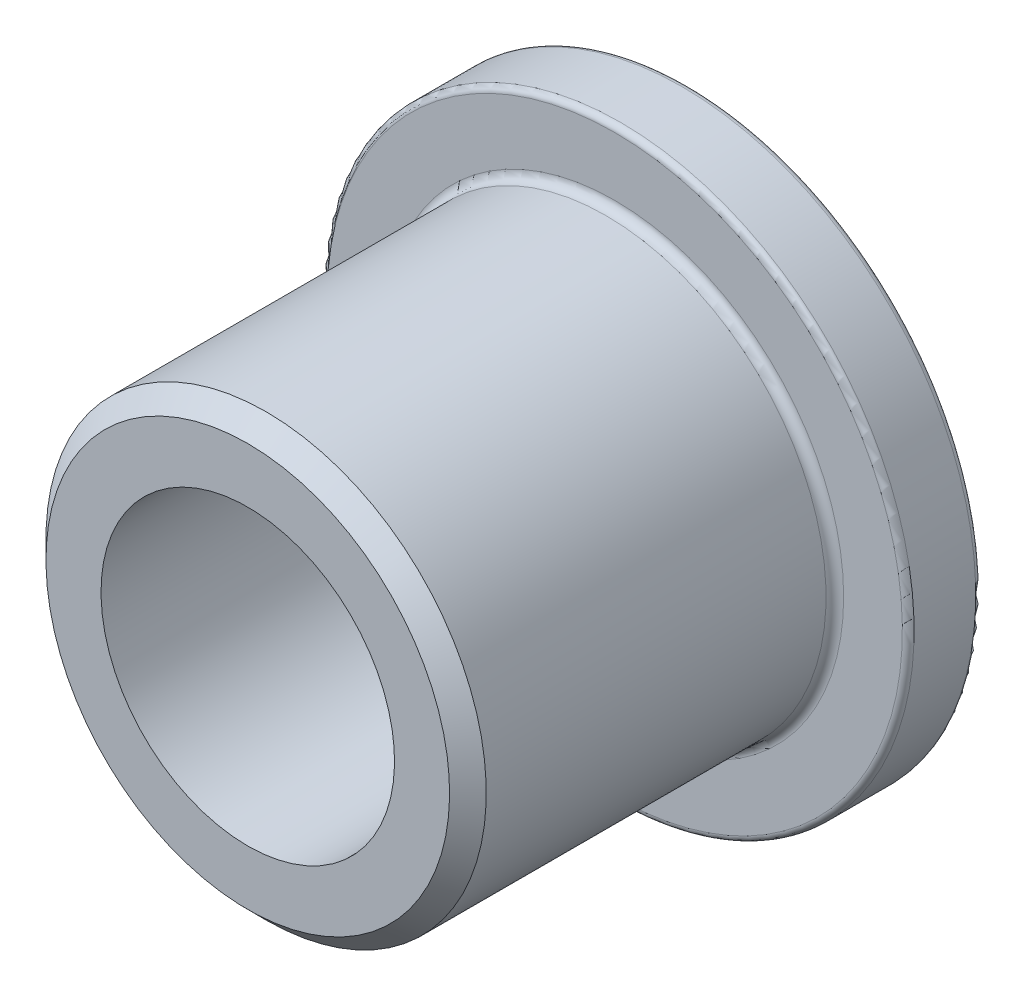
ISO-10303-21;
HEADER;
FILE_DESCRIPTION(('STEP AP214'),'2;1');
FILE_NAME('part.step','',(''),(''),'','','');
FILE_SCHEMA(('AUTOMOTIVE_DESIGN { 1 0 10303 214 1 1 1 1 }'));
ENDSEC;
DATA;
#1=APPLICATION_CONTEXT('core data for automotive mechanical design processes');
#2=APPLICATION_PROTOCOL_DEFINITION('international standard','automotive_design',2000,#1);
#3=PRODUCT_CONTEXT('',#1,'mechanical');
#4=PRODUCT('Part','Part','',(#3));
#5=PRODUCT_RELATED_PRODUCT_CATEGORY('part','',(#4));
#6=PRODUCT_DEFINITION_FORMATION('','',#4);
#7=PRODUCT_DEFINITION_CONTEXT('part definition',#1,'design');
#8=PRODUCT_DEFINITION('design','',#6,#7);
#9=PRODUCT_DEFINITION_SHAPE('','',#8);
#10=(LENGTH_UNIT() NAMED_UNIT(*) SI_UNIT(.MILLI.,.METRE.));
#11=(NAMED_UNIT(*) PLANE_ANGLE_UNIT() SI_UNIT($,.RADIAN.));
#12=(NAMED_UNIT(*) SI_UNIT($,.STERADIAN.) SOLID_ANGLE_UNIT());
#13=UNCERTAINTY_MEASURE_WITH_UNIT(LENGTH_MEASURE(1.E-05),#10,'distance_accuracy_value','');
#14=(GEOMETRIC_REPRESENTATION_CONTEXT(3) GLOBAL_UNCERTAINTY_ASSIGNED_CONTEXT((#13)) GLOBAL_UNIT_ASSIGNED_CONTEXT((#10,
#11,#12)) REPRESENTATION_CONTEXT('',''));
#15=CARTESIAN_POINT('',(0.,0.,0.));
#16=DIRECTION('',(0.,0.,1.));
#17=DIRECTION('',(1.,0.,0.));
#18=AXIS2_PLACEMENT_3D('',#15,#16,#17);
#19=CARTESIAN_POINT('',(0.,4.7625,4.7625));
#20=DIRECTION('',(0.,0.,-1.));
#21=DIRECTION('',(0.,1.,0.));
#22=AXIS2_PLACEMENT_3D('',#19,#20,#21);
#23=PLANE('',#22);
#24=CARTESIAN_POINT('',(0.,0.,4.7625));
#25=DIRECTION('',(0.,0.,-1.));
#26=DIRECTION('',(0.,1.,0.));
#27=AXIS2_PLACEMENT_3D('',#24,#25,#26);
#28=CIRCLE('',#27,4.365625);
#29=CARTESIAN_POINT('',(0.,4.365625,4.7625));
#30=VERTEX_POINT('',#29);
#31=EDGE_CURVE('E69',#30,#30,#28,.F.);
#32=ORIENTED_EDGE('',*,*,#31,.T.);
#33=EDGE_LOOP('',(#32));
#34=FACE_BOUND('',#33,.T.);
#35=CARTESIAN_POINT('',(0.,0.,4.7625));
#36=DIRECTION('',(0.,0.,1.));
#37=DIRECTION('',(0.,-1.,0.));
#38=AXIS2_PLACEMENT_3D('',#35,#36,#37);
#39=CIRCLE('',#38,3.175);
#40=CARTESIAN_POINT('',(0.,-3.175,4.7625));
#41=VERTEX_POINT('',#40);
#42=EDGE_CURVE('E72',#41,#41,#39,.T.);
#43=ORIENTED_EDGE('',*,*,#42,.F.);
#44=EDGE_LOOP('',(#43));
#45=FACE_BOUND('',#44,.T.);
#46=ADVANCED_FACE('F34',(#34,#45),#23,.F.);
#47=CARTESIAN_POINT('',(0.,0.,4.7625));
#48=DIRECTION('',(0.,0.,1.));
#49=DIRECTION('',(0.,-1.,0.));
#50=AXIS2_PLACEMENT_3D('',#47,#48,#49);
#51=CYLINDRICAL_SURFACE('',#50,3.175);
#52=CARTESIAN_POINT('',(0.,0.,-4.44499999999999));
#53=DIRECTION('',(0.,0.,1.));
#54=DIRECTION('',(0.,-1.,0.));
#55=AXIS2_PLACEMENT_3D('',#52,#53,#54);
#56=CIRCLE('',#55,3.175);
#57=CARTESIAN_POINT('',(0.,-3.175,-4.44499999999999));
#58=VERTEX_POINT('',#57);
#59=EDGE_CURVE('E10',#58,#58,#56,.F.);
#60=ORIENTED_EDGE('',*,*,#59,.T.);
#61=EDGE_LOOP('',(#60));
#62=FACE_BOUND('',#61,.T.);
#63=ORIENTED_EDGE('',*,*,#42,.T.);
#64=EDGE_LOOP('',(#63));
#65=FACE_BOUND('',#64,.T.);
#66=ADVANCED_FACE('F76',(#62,#65),#51,.F.);
#67=CARTESIAN_POINT('',(0.,3.175,-4.7625));
#68=DIRECTION('',(0.,0.,1.));
#69=DIRECTION('',(0.,-1.,0.));
#70=AXIS2_PLACEMENT_3D('',#67,#68,#69);
#71=PLANE('',#70);
#72=CARTESIAN_POINT('',(0.,0.,-4.7625));
#73=DIRECTION('',(0.,0.,1.));
#74=DIRECTION('',(0.,-1.,0.));
#75=AXIS2_PLACEMENT_3D('',#72,#73,#74);
#76=CIRCLE('',#75,3.4925);
#77=CARTESIAN_POINT('',(0.,-3.4925,-4.7625));
#78=VERTEX_POINT('',#77);
#79=EDGE_CURVE('E41',#78,#78,#76,.T.);
#80=ORIENTED_EDGE('',*,*,#79,.T.);
#81=EDGE_LOOP('',(#80));
#82=FACE_BOUND('',#81,.T.);
#83=CARTESIAN_POINT('',(0.,0.,-4.7625));
#84=DIRECTION('',(0.,0.,1.));
#85=DIRECTION('',(0.,-1.,0.));
#86=AXIS2_PLACEMENT_3D('',#83,#84,#85);
#87=CIRCLE('',#86,6.223);
#88=CARTESIAN_POINT('',(0.,-6.223,-4.7625));
#89=VERTEX_POINT('',#88);
#90=EDGE_CURVE('E49',#89,#89,#87,.F.);
#91=ORIENTED_EDGE('',*,*,#90,.T.);
#92=EDGE_LOOP('',(#91));
#93=FACE_BOUND('',#92,.T.);
#94=ADVANCED_FACE('F84',(#82,#93),#71,.F.);
#95=CARTESIAN_POINT('',(0.,0.,4.7625));
#96=DIRECTION('',(0.,0.,1.));
#97=DIRECTION('',(0.,-1.,0.));
#98=AXIS2_PLACEMENT_3D('',#95,#96,#97);
#99=CYLINDRICAL_SURFACE('',#98,6.35);
#100=CARTESIAN_POINT('',(0.,0.,-4.6355));
#101=DIRECTION('',(0.,0.,1.));
#102=DIRECTION('',(0.,-1.,0.));
#103=AXIS2_PLACEMENT_3D('',#100,#101,#102);
#104=CIRCLE('',#103,6.35);
#105=CARTESIAN_POINT('',(0.,-6.35,-4.6355));
#106=VERTEX_POINT('',#105);
#107=EDGE_CURVE('E54',#106,#106,#104,.T.);
#108=ORIENTED_EDGE('',*,*,#107,.T.);
#109=EDGE_LOOP('',(#108));
#110=FACE_BOUND('',#109,.T.);
#111=CARTESIAN_POINT('',(0.,0.,-3.302));
#112=DIRECTION('',(0.,0.,-1.));
#113=DIRECTION('',(0.,1.,0.));
#114=AXIS2_PLACEMENT_3D('',#111,#112,#113);
#115=CIRCLE('',#114,6.35);
#116=CARTESIAN_POINT('',(0.,6.35,-3.302));
#117=VERTEX_POINT('',#116);
#118=EDGE_CURVE('E57',#117,#117,#115,.T.);
#119=ORIENTED_EDGE('',*,*,#118,.T.);
#120=EDGE_LOOP('',(#119));
#121=FACE_BOUND('',#120,.T.);
#122=ADVANCED_FACE('F114',(#110,#121),#99,.T.);
#123=CARTESIAN_POINT('',(0.,6.35,-3.175));
#124=DIRECTION('',(0.,0.,-1.));
#125=DIRECTION('',(0.,1.,0.));
#126=AXIS2_PLACEMENT_3D('',#123,#124,#125);
#127=PLANE('',#126);
#128=CARTESIAN_POINT('',(0.,0.,-3.175));
#129=DIRECTION('',(0.,0.,-1.));
#130=DIRECTION('',(0.,1.,0.));
#131=AXIS2_PLACEMENT_3D('',#128,#129,#130);
#132=CIRCLE('',#131,6.223);
#133=CARTESIAN_POINT('',(0.,6.223,-3.175));
#134=VERTEX_POINT('',#133);
#135=EDGE_CURVE('E45',#134,#134,#132,.F.);
#136=ORIENTED_EDGE('',*,*,#135,.T.);
#137=EDGE_LOOP('',(#136));
#138=FACE_BOUND('',#137,.T.);
#139=CARTESIAN_POINT('',(0.,0.,-3.175));
#140=DIRECTION('',(0.,0.,-1.));
#141=DIRECTION('',(0.,1.,0.));
#142=AXIS2_PLACEMENT_3D('',#139,#140,#141);
#143=CIRCLE('',#142,4.953);
#144=CARTESIAN_POINT('',(0.,4.953,-3.175));
#145=VERTEX_POINT('',#144);
#146=EDGE_CURVE('E60',#145,#145,#143,.T.);
#147=ORIENTED_EDGE('',*,*,#146,.T.);
#148=EDGE_LOOP('',(#147));
#149=FACE_BOUND('',#148,.T.);
#150=ADVANCED_FACE('F111',(#138,#149),#127,.F.);
#151=CARTESIAN_POINT('',(0.,0.,4.7625));
#152=DIRECTION('',(0.,0.,1.));
#153=DIRECTION('',(0.,-1.,0.));
#154=AXIS2_PLACEMENT_3D('',#151,#152,#153);
#155=CYLINDRICAL_SURFACE('',#154,4.7625);
#156=CARTESIAN_POINT('',(0.,0.,-2.9845));
#157=DIRECTION('',(0.,0.,-1.));
#158=DIRECTION('',(0.,1.,0.));
#159=AXIS2_PLACEMENT_3D('',#156,#157,#158);
#160=CIRCLE('',#159,4.7625);
#161=CARTESIAN_POINT('',(0.,4.7625,-2.9845));
#162=VERTEX_POINT('',#161);
#163=EDGE_CURVE('E63',#162,#162,#160,.F.);
#164=ORIENTED_EDGE('',*,*,#163,.T.);
#165=EDGE_LOOP('',(#164));
#166=FACE_BOUND('',#165,.T.);
#167=CARTESIAN_POINT('',(0.,0.,4.365625));
#168=DIRECTION('',(0.,0.,-1.));
#169=DIRECTION('',(0.,1.,0.));
#170=AXIS2_PLACEMENT_3D('',#167,#168,#169);
#171=CIRCLE('',#170,4.7625);
#172=CARTESIAN_POINT('',(0.,4.7625,4.365625));
#173=VERTEX_POINT('',#172);
#174=EDGE_CURVE('E66',#173,#173,#171,.T.);
#175=ORIENTED_EDGE('',*,*,#174,.T.);
#176=EDGE_LOOP('',(#175));
#177=FACE_BOUND('',#176,.T.);
#178=ADVANCED_FACE('F92',(#166,#177),#155,.T.);
#179=CARTESIAN_POINT('',(0.,0.,4.7625));
#180=DIRECTION('',(0.,0.,-1.));
#181=DIRECTION('',(0.,1.,0.));
#182=AXIS2_PLACEMENT_3D('',#179,#180,#181);
#183=CONICAL_SURFACE('',#182,4.365625,0.785398163397446);
#184=ORIENTED_EDGE('',*,*,#174,.F.);
#185=EDGE_LOOP('',(#184));
#186=FACE_BOUND('',#185,.T.);
#187=ORIENTED_EDGE('',*,*,#31,.F.);
#188=EDGE_LOOP('',(#187));
#189=FACE_BOUND('',#188,.T.);
#190=ADVANCED_FACE('F88',(#186,#189),#183,.T.);
#191=CARTESIAN_POINT('',(0.,0.,-2.9845));
#192=DIRECTION('',(0.,0.,-1.));
#193=DIRECTION('',(0.,1.,0.));
#194=AXIS2_PLACEMENT_3D('',#191,#192,#193);
#195=TOROIDAL_SURFACE('',#194,4.953,0.1905);
#196=ORIENTED_EDGE('',*,*,#146,.F.);
#197=EDGE_LOOP('',(#196));
#198=FACE_BOUND('',#197,.T.);
#199=ORIENTED_EDGE('',*,*,#163,.F.);
#200=EDGE_LOOP('',(#199));
#201=FACE_BOUND('',#200,.T.);
#202=ADVANCED_FACE('F91',(#198,#201),#195,.F.);
#203=CARTESIAN_POINT('',(0.,0.,-4.6355));
#204=DIRECTION('',(0.,0.,1.));
#205=DIRECTION('',(0.,-1.,0.));
#206=AXIS2_PLACEMENT_3D('',#203,#204,#205);
#207=TOROIDAL_SURFACE('',#206,6.223,0.127);
#208=ORIENTED_EDGE('',*,*,#90,.F.);
#209=EDGE_LOOP('',(#208));
#210=FACE_BOUND('',#209,.T.);
#211=ORIENTED_EDGE('',*,*,#107,.F.);
#212=EDGE_LOOP('',(#211));
#213=FACE_BOUND('',#212,.T.);
#214=ADVANCED_FACE('F96',(#210,#213),#207,.T.);
#215=CARTESIAN_POINT('',(0.,0.,-3.302));
#216=DIRECTION('',(0.,0.,-1.));
#217=DIRECTION('',(0.,1.,0.));
#218=AXIS2_PLACEMENT_3D('',#215,#216,#217);
#219=TOROIDAL_SURFACE('',#218,6.223,0.127);
#220=ORIENTED_EDGE('',*,*,#118,.F.);
#221=EDGE_LOOP('',(#220));
#222=FACE_BOUND('',#221,.T.);
#223=ORIENTED_EDGE('',*,*,#135,.F.);
#224=EDGE_LOOP('',(#223));
#225=FACE_BOUND('',#224,.T.);
#226=ADVANCED_FACE('F99',(#222,#225),#219,.T.);
#227=CARTESIAN_POINT('',(0.,0.,-4.7625));
#228=DIRECTION('',(0.,0.,-1.));
#229=DIRECTION('',(0.,1.,0.));
#230=AXIS2_PLACEMENT_3D('',#227,#228,#229);
#231=CONICAL_SURFACE('',#230,3.4925,0.785398163397448);
#232=ORIENTED_EDGE('',*,*,#59,.F.);
#233=EDGE_LOOP('',(#232));
#234=FACE_BOUND('',#233,.T.);
#235=ORIENTED_EDGE('',*,*,#79,.F.);
#236=EDGE_LOOP('',(#235));
#237=FACE_BOUND('',#236,.T.);
#238=ADVANCED_FACE('F36',(#234,#237),#231,.F.);
#239=CLOSED_SHELL('',(#46,#66,#94,#122,#150,#178,#190,#202,#214,#226,#238));
#240=MANIFOLD_SOLID_BREP('B2',#239);
#241=ADVANCED_BREP_SHAPE_REPRESENTATION('',(#18,#240),#14);
#242=SHAPE_DEFINITION_REPRESENTATION(#9,#241);
ENDSEC;
END-ISO-10303-21;
